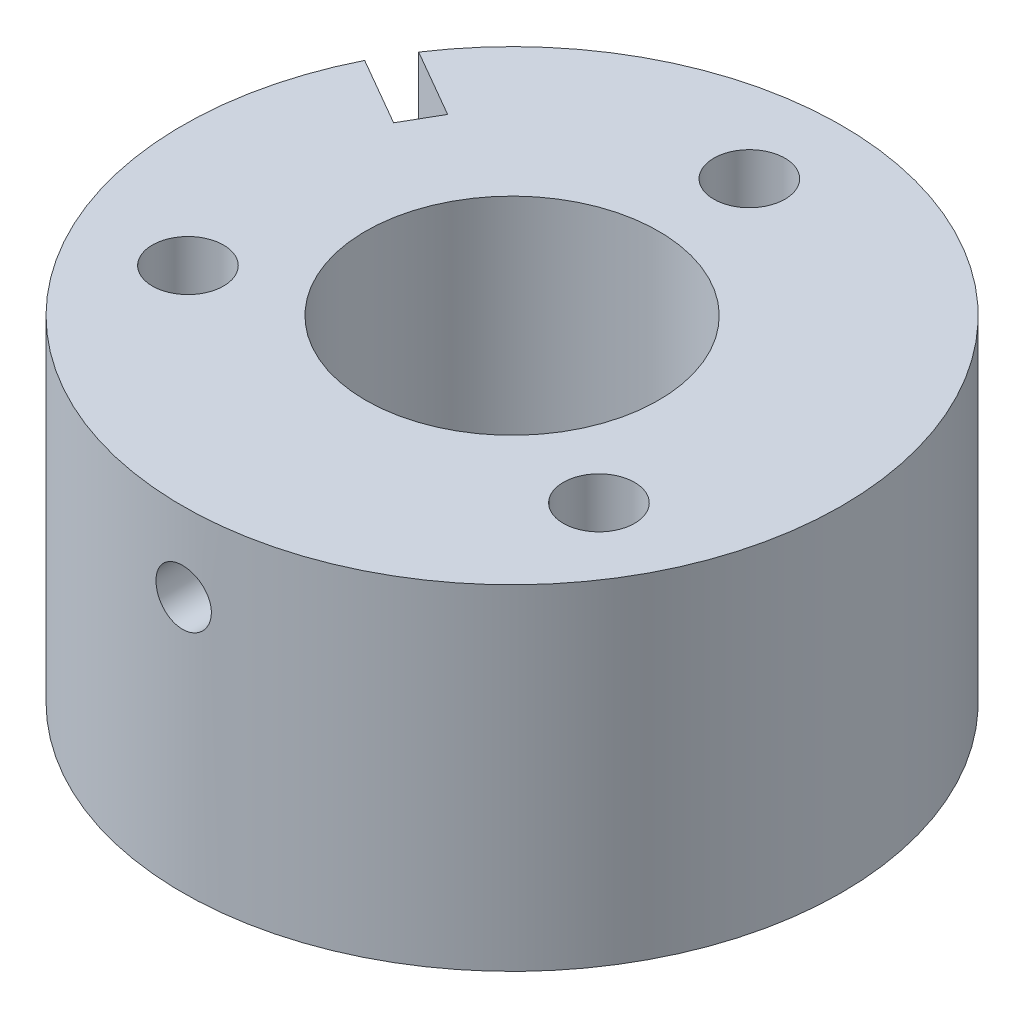
ISO-10303-21;
HEADER;
FILE_DESCRIPTION(('STEP AP214'),'2;1');
FILE_NAME('part.step','',(''),(''),'','','');
FILE_SCHEMA(('AUTOMOTIVE_DESIGN { 1 0 10303 214 1 1 1 1 }'));
ENDSEC;
DATA;
#1=APPLICATION_CONTEXT('core data for automotive mechanical design processes');
#2=APPLICATION_PROTOCOL_DEFINITION('international standard','automotive_design',2000,#1);
#3=PRODUCT_CONTEXT('',#1,'mechanical');
#4=PRODUCT('Part','Part','',(#3));
#5=PRODUCT_RELATED_PRODUCT_CATEGORY('part','',(#4));
#6=PRODUCT_DEFINITION_FORMATION('','',#4);
#7=PRODUCT_DEFINITION_CONTEXT('part definition',#1,'design');
#8=PRODUCT_DEFINITION('design','',#6,#7);
#9=PRODUCT_DEFINITION_SHAPE('','',#8);
#10=(LENGTH_UNIT() NAMED_UNIT(*) SI_UNIT(.MILLI.,.METRE.));
#11=(NAMED_UNIT(*) PLANE_ANGLE_UNIT() SI_UNIT($,.RADIAN.));
#12=(NAMED_UNIT(*) SI_UNIT($,.STERADIAN.) SOLID_ANGLE_UNIT());
#13=UNCERTAINTY_MEASURE_WITH_UNIT(LENGTH_MEASURE(1.E-05),#10,'distance_accuracy_value','');
#14=(GEOMETRIC_REPRESENTATION_CONTEXT(3) GLOBAL_UNCERTAINTY_ASSIGNED_CONTEXT((#13)) GLOBAL_UNIT_ASSIGNED_CONTEXT((#10,
#11,#12)) REPRESENTATION_CONTEXT('',''));
#15=CARTESIAN_POINT('',(0.,0.,0.));
#16=DIRECTION('',(0.,0.,1.));
#17=DIRECTION('',(1.,0.,0.));
#18=AXIS2_PLACEMENT_3D('',#15,#16,#17);
#19=CARTESIAN_POINT('',(0.,12.7,0.));
#20=DIRECTION('',(0.,1.,0.));
#21=DIRECTION('',(0.,0.,1.));
#22=AXIS2_PLACEMENT_3D('',#19,#20,#21);
#23=PLANE('',#22);
#24=CARTESIAN_POINT('',(15.5884572681199,12.7,8.99999999999999));
#25=DIRECTION('',(0.,1.,0.));
#26=DIRECTION('',(0.,0.,1.));
#27=AXIS2_PLACEMENT_3D('',#24,#25,#26);
#28=CIRCLE('',#27,2.6999999999993);
#29=CARTESIAN_POINT('',(15.5884572681199,12.7,11.6999999999993));
#30=VERTEX_POINT('',#29);
#31=EDGE_CURVE('E128',#30,#30,#28,.T.);
#32=ORIENTED_EDGE('',*,*,#31,.F.);
#33=EDGE_LOOP('',(#32));
#34=FACE_BOUND('',#33,.T.);
#35=CARTESIAN_POINT('',(0.,12.7,0.));
#36=DIRECTION('',(0.,1.,0.));
#37=DIRECTION('',(0.,0.,1.));
#38=AXIS2_PLACEMENT_3D('',#35,#36,#37);
#39=CIRCLE('',#38,11.1125);
#40=CARTESIAN_POINT('',(0.,12.7,11.1125));
#41=VERTEX_POINT('',#40);
#42=EDGE_CURVE('E107',#41,#41,#39,.T.);
#43=ORIENTED_EDGE('',*,*,#42,.F.);
#44=EDGE_LOOP('',(#43));
#45=FACE_BOUND('',#44,.T.);
#46=CARTESIAN_POINT('',(0.,12.7,0.));
#47=DIRECTION('',(0.,1.,0.));
#48=DIRECTION('',(0.,0.,1.));
#49=AXIS2_PLACEMENT_3D('',#46,#47,#48);
#50=CIRCLE('',#49,25.0000000000001);
#51=CARTESIAN_POINT('',(-22.3616288141362,12.7,-11.1784416077912));
#52=VERTEX_POINT('',#51);
#53=CARTESIAN_POINT('',(-20.8616288141362,12.7,-13.7765178191445));
#54=VERTEX_POINT('',#53);
#55=EDGE_CURVE('E92',#52,#54,#50,.T.);
#56=ORIENTED_EDGE('',*,*,#55,.T.);
#57=DIRECTION('',(0.866025403784439,0.,0.5));
#58=VECTOR('',#57,1.);
#59=CARTESIAN_POINT('',(-15.6654763914296,12.7,-10.7765178191445));
#60=LINE('',#59,#58);
#61=CARTESIAN_POINT('',(-15.6654763914296,12.7,-10.7765178191445));
#62=VERTEX_POINT('',#61);
#63=EDGE_CURVE('E87',#54,#62,#60,.T.);
#64=ORIENTED_EDGE('',*,*,#63,.T.);
#65=DIRECTION('',(-0.5,0.,0.866025403784439));
#66=VECTOR('',#65,1.);
#67=CARTESIAN_POINT('',(-15.6654763914296,12.7,-10.7765178191445));
#68=LINE('',#67,#66);
#69=CARTESIAN_POINT('',(-17.1654763914296,12.7,-8.17844160779118));
#70=VERTEX_POINT('',#69);
#71=EDGE_CURVE('E90',#62,#70,#68,.T.);
#72=ORIENTED_EDGE('',*,*,#71,.T.);
#73=DIRECTION('',(-0.866025403784437,0.,-0.500000000000003));
#74=VECTOR('',#73,1.);
#75=CARTESIAN_POINT('',(-17.1654763914296,12.7,-8.17844160779118));
#76=LINE('',#75,#74);
#77=EDGE_CURVE('E57',#70,#52,#76,.T.);
#78=ORIENTED_EDGE('',*,*,#77,.T.);
#79=EDGE_LOOP('',(#56,#64,#72,#78));
#80=FACE_BOUND('',#79,.T.);
#81=CARTESIAN_POINT('',(0.,12.7,-18.));
#82=DIRECTION('',(0.,1.,0.));
#83=DIRECTION('',(0.,0.,1.));
#84=AXIS2_PLACEMENT_3D('',#81,#82,#83);
#85=CIRCLE('',#84,2.6999999999993);
#86=CARTESIAN_POINT('',(0.,12.7,-15.3000000000007));
#87=VERTEX_POINT('',#86);
#88=EDGE_CURVE('E122',#87,#87,#85,.T.);
#89=ORIENTED_EDGE('',*,*,#88,.F.);
#90=EDGE_LOOP('',(#89));
#91=FACE_BOUND('',#90,.T.);
#92=CARTESIAN_POINT('',(-15.5884572681199,12.7,9.00000000000001));
#93=DIRECTION('',(0.,1.,0.));
#94=DIRECTION('',(0.,0.,1.));
#95=AXIS2_PLACEMENT_3D('',#92,#93,#94);
#96=CIRCLE('',#95,2.6999999999993);
#97=CARTESIAN_POINT('',(-15.5884572681199,12.7,11.6999999999993));
#98=VERTEX_POINT('',#97);
#99=EDGE_CURVE('E134',#98,#98,#96,.T.);
#100=ORIENTED_EDGE('',*,*,#99,.F.);
#101=EDGE_LOOP('',(#100));
#102=FACE_BOUND('',#101,.T.);
#103=ADVANCED_FACE('F39',(#34,#45,#80,#91,#102),#23,.T.);
#104=CARTESIAN_POINT('',(0.,-12.7,0.));
#105=DIRECTION('',(0.,1.,0.));
#106=DIRECTION('',(0.,0.,1.));
#107=AXIS2_PLACEMENT_3D('',#104,#105,#106);
#108=PLANE('',#107);
#109=CARTESIAN_POINT('',(0.,-12.7,0.));
#110=DIRECTION('',(0.,1.,0.));
#111=DIRECTION('',(0.,0.,1.));
#112=AXIS2_PLACEMENT_3D('',#109,#110,#111);
#113=CIRCLE('',#112,25.0000000000001);
#114=CARTESIAN_POINT('',(-22.3616288141362,-12.7,-11.1784416077912));
#115=VERTEX_POINT('',#114);
#116=CARTESIAN_POINT('',(-20.8616288141362,-12.7,-13.7765178191445));
#117=VERTEX_POINT('',#116);
#118=EDGE_CURVE('E104',#115,#117,#113,.T.);
#119=ORIENTED_EDGE('',*,*,#118,.F.);
#120=DIRECTION('',(-0.866025403784437,0.,-0.500000000000003));
#121=VECTOR('',#120,1.);
#122=CARTESIAN_POINT('',(-17.1654763914296,-12.7,-8.17844160779118));
#123=LINE('',#122,#121);
#124=CARTESIAN_POINT('',(-17.1654763914296,-12.7,-8.17844160779118));
#125=VERTEX_POINT('',#124);
#126=EDGE_CURVE('E80',#125,#115,#123,.T.);
#127=ORIENTED_EDGE('',*,*,#126,.F.);
#128=DIRECTION('',(-0.5,0.,0.866025403784439));
#129=VECTOR('',#128,1.);
#130=CARTESIAN_POINT('',(-15.6654763914296,-12.7,-10.7765178191445));
#131=LINE('',#130,#129);
#132=CARTESIAN_POINT('',(-15.6654763914296,-12.7,-10.7765178191445));
#133=VERTEX_POINT('',#132);
#134=EDGE_CURVE('E74',#133,#125,#131,.T.);
#135=ORIENTED_EDGE('',*,*,#134,.F.);
#136=DIRECTION('',(0.866025403784439,0.,0.5));
#137=VECTOR('',#136,1.);
#138=CARTESIAN_POINT('',(-15.6654763914296,-12.7,-10.7765178191445));
#139=LINE('',#138,#137);
#140=EDGE_CURVE('E96',#117,#133,#139,.T.);
#141=ORIENTED_EDGE('',*,*,#140,.F.);
#142=EDGE_LOOP('',(#119,#127,#135,#141));
#143=FACE_BOUND('',#142,.T.);
#144=CARTESIAN_POINT('',(0.,-12.7,0.));
#145=DIRECTION('',(0.,1.,0.));
#146=DIRECTION('',(0.,0.,1.));
#147=AXIS2_PLACEMENT_3D('',#144,#145,#146);
#148=CIRCLE('',#147,11.1125);
#149=CARTESIAN_POINT('',(0.,-12.7,11.1125));
#150=VERTEX_POINT('',#149);
#151=EDGE_CURVE('E119',#150,#150,#148,.T.);
#152=ORIENTED_EDGE('',*,*,#151,.T.);
#153=EDGE_LOOP('',(#152));
#154=FACE_BOUND('',#153,.T.);
#155=CARTESIAN_POINT('',(0.,-12.7,-18.));
#156=DIRECTION('',(0.,1.,0.));
#157=DIRECTION('',(0.,0.,1.));
#158=AXIS2_PLACEMENT_3D('',#155,#156,#157);
#159=CIRCLE('',#158,2.6999999999993);
#160=CARTESIAN_POINT('',(0.,-12.7,-15.3000000000007));
#161=VERTEX_POINT('',#160);
#162=EDGE_CURVE('E125',#161,#161,#159,.T.);
#163=ORIENTED_EDGE('',*,*,#162,.T.);
#164=EDGE_LOOP('',(#163));
#165=FACE_BOUND('',#164,.T.);
#166=CARTESIAN_POINT('',(15.5884572681199,-12.7,8.99999999999999));
#167=DIRECTION('',(0.,1.,0.));
#168=DIRECTION('',(0.,0.,1.));
#169=AXIS2_PLACEMENT_3D('',#166,#167,#168);
#170=CIRCLE('',#169,2.6999999999993);
#171=CARTESIAN_POINT('',(15.5884572681199,-12.7,11.6999999999993));
#172=VERTEX_POINT('',#171);
#173=EDGE_CURVE('E131',#172,#172,#170,.T.);
#174=ORIENTED_EDGE('',*,*,#173,.T.);
#175=EDGE_LOOP('',(#174));
#176=FACE_BOUND('',#175,.T.);
#177=CARTESIAN_POINT('',(-15.5884572681199,-12.7,9.00000000000001));
#178=DIRECTION('',(0.,1.,0.));
#179=DIRECTION('',(0.,0.,1.));
#180=AXIS2_PLACEMENT_3D('',#177,#178,#179);
#181=CIRCLE('',#180,2.6999999999993);
#182=CARTESIAN_POINT('',(-15.5884572681199,-12.7,11.6999999999993));
#183=VERTEX_POINT('',#182);
#184=EDGE_CURVE('E137',#183,#183,#181,.T.);
#185=ORIENTED_EDGE('',*,*,#184,.T.);
#186=EDGE_LOOP('',(#185));
#187=FACE_BOUND('',#186,.T.);
#188=ADVANCED_FACE('F115',(#143,#154,#165,#176,#187),#108,.F.);
#189=CARTESIAN_POINT('',(0.,12.7,0.));
#190=DIRECTION('',(0.,-1.,0.));
#191=DIRECTION('',(0.,0.,-1.));
#192=AXIS2_PLACEMENT_3D('',#189,#190,#191);
#193=CYLINDRICAL_SURFACE('',#192,25.0000000000001);
#194=CARTESIAN_POINT('',(2.09999999999999,6.7,24.9116438638642));
#195=CARTESIAN_POINT('',(2.09999485837673,6.5822655479677,24.9116450340083));
#196=CARTESIAN_POINT('',(2.0900656885766,6.46445102839802,24.9124874834673));
#197=CARTESIAN_POINT('',(2.0506026486121,6.2320820056589,24.9157662067991));
#198=CARTESIAN_POINT('',(2.02104658688871,6.11753134591671,24.9182042847579));
#199=CARTESIAN_POINT('',(1.94319080564175,5.89508914344277,24.9243961881864));
#200=CARTESIAN_POINT('',(1.8949017392842,5.7871938562515,24.9281492657193));
#201=CARTESIAN_POINT('',(1.78096970235171,5.58106572133331,24.9365473557691));
#202=CARTESIAN_POINT('',(1.71533043218995,5.48283081938307,24.9411921780388));
#203=CARTESIAN_POINT('',(1.5683764393424,5.29853036396334,24.9508639946303));
#204=CARTESIAN_POINT('',(1.48702583714909,5.21249346186846,24.9558918474412));
#205=CARTESIAN_POINT('',(1.31103436432751,5.05527744226912,24.9657553521438));
#206=CARTESIAN_POINT('',(1.21639291236684,4.98409897500091,24.9705909956166));
#207=CARTESIAN_POINT('',(1.01633518620386,4.8585248477625,24.9795333807492));
#208=CARTESIAN_POINT('',(0.910903282822711,4.80415400375027,24.9836390408491));
#209=CARTESIAN_POINT('',(0.692366478248451,4.71389724938874,24.9906496091806));
#210=CARTESIAN_POINT('',(0.579261713319254,4.67801101086477,24.9935545387296));
#211=CARTESIAN_POINT('',(0.348875196706301,4.62582469122496,24.9978303389121));
#212=CARTESIAN_POINT('',(0.231604021202069,4.60947822187939,24.9992048423071));
#213=CARTESIAN_POINT('',(-0.00402498468595406,4.59669205075256,25.0002772328337));
#214=CARTESIAN_POINT('',(-0.122382794528716,4.60025197344415,24.9999751515934));
#215=CARTESIAN_POINT('',(-0.356510772580105,4.62713960525297,24.9977314059567));
#216=CARTESIAN_POINT('',(-0.472286714690108,4.65041743058994,24.9957938790727));
#217=CARTESIAN_POINT('',(-0.698282390737076,4.71600252564907,24.9905019225894));
#218=CARTESIAN_POINT('',(-0.808502071078081,4.75830997889286,24.9871474793254));
#219=CARTESIAN_POINT('',(-1.02041516909043,4.8608089398128,24.9793919423598));
#220=CARTESIAN_POINT('',(-1.12209773588735,4.92102277851909,24.9749895431297));
#221=CARTESIAN_POINT('',(-1.31393178034515,5.05760904543361,24.965632801841));
#222=CARTESIAN_POINT('',(-1.40408302023144,5.13398180675075,24.9606784484051));
#223=CARTESIAN_POINT('',(-1.57058703233806,5.30099910253072,24.9507564963594));
#224=CARTESIAN_POINT('',(-1.64689633036721,5.39168698463369,24.9457889040978));
#225=CARTESIAN_POINT('',(-1.7832144194432,5.58460918774314,24.9364157410182));
#226=CARTESIAN_POINT('',(-1.84322319673741,5.68684351849117,24.9320101706744));
#227=CARTESIAN_POINT('',(-1.9452352132766,5.8999871910908,24.9242590728123));
#228=CARTESIAN_POINT('',(-1.98723618059359,6.01089762546383,24.9209136790635));
#229=CARTESIAN_POINT('',(-2.05200805519726,6.23823052951627,24.9156643136639));
#230=CARTESIAN_POINT('',(-2.07477937335143,6.35465288136996,24.913760311216));
#231=CARTESIAN_POINT('',(-2.1003904872527,6.5893243515587,24.9116143147338));
#232=CARTESIAN_POINT('',(-2.10329091543526,6.70756680842718,24.9113672648563));
#233=CARTESIAN_POINT('',(-2.0892367577445,6.94285625286254,24.9125498004859));
#234=CARTESIAN_POINT('',(-2.07228236008529,7.05990325175117,24.9139793700996));
#235=CARTESIAN_POINT('',(-2.01905037765816,7.28930508015701,24.9183494582227));
#236=CARTESIAN_POINT('',(-1.98280110224445,7.40166652452233,24.9212877629006));
#237=CARTESIAN_POINT('',(-1.89203713238139,7.61871264576482,24.9283424129882));
#238=CARTESIAN_POINT('',(-1.83752214022684,7.72339719748567,24.9324587775985));
#239=CARTESIAN_POINT('',(-1.71162084891762,7.92239534039936,24.9414179916391));
#240=CARTESIAN_POINT('',(-1.6401941539115,8.01668329509456,24.9462625702289));
#241=CARTESIAN_POINT('',(-1.48255532413534,8.1919526188989,24.9561265079214));
#242=CARTESIAN_POINT('',(-1.39634293089238,8.27293375533937,24.9611458700783));
#243=CARTESIAN_POINT('',(-1.2113179096318,8.41949772109362,24.9708088774811));
#244=CARTESIAN_POINT('',(-1.11247401302687,8.48504114992997,24.9754515419526));
#245=CARTESIAN_POINT('',(-0.905147552473084,8.59859879154609,24.9838239053897));
#246=CARTESIAN_POINT('',(-0.796665086184913,8.6466131819098,24.9875536136041));
#247=CARTESIAN_POINT('',(-0.573281955114179,8.72368216325211,24.9936753143798));
#248=CARTESIAN_POINT('',(-0.458389738137441,8.75276109817345,24.9960690239694));
#249=CARTESIAN_POINT('',(-0.225332660676086,8.79121328415376,24.9992559942986));
#250=CARTESIAN_POINT('',(-0.107167863276114,8.80058691479902,25.0000492858673));
#251=CARTESIAN_POINT('',(0.128691779064639,8.79935794803171,24.9999460825968));
#252=CARTESIAN_POINT('',(0.24638695105143,8.78881674589167,24.9990547811718));
#253=CARTESIAN_POINT('',(0.478329052487317,8.74818539505718,24.9956928100986));
#254=CARTESIAN_POINT('',(0.592575977314614,8.7180952201618,24.9932221383337));
#255=CARTESIAN_POINT('',(0.814382353868544,8.6392357306572,24.9869786240988));
#256=CARTESIAN_POINT('',(0.921942209668017,8.59046754596302,24.9832058603995));
#257=CARTESIAN_POINT('',(1.12735778964129,8.47564340609865,24.974780183067));
#258=CARTESIAN_POINT('',(1.22521366367532,8.40958771795963,24.9701272830291));
#259=CARTESIAN_POINT('',(1.40875773536067,8.26183319533304,24.9604464652695));
#260=CARTESIAN_POINT('',(1.4944092918562,8.1800889141873,24.9554174846036));
#261=CARTESIAN_POINT('',(1.65081115644468,8.00336008506129,24.9455603449089));
#262=CARTESIAN_POINT('',(1.72155785197054,7.90837233644375,24.9407322347931));
#263=CARTESIAN_POINT('',(1.84623917423496,7.70766567114242,24.9318135639044));
#264=CARTESIAN_POINT('',(1.90014164331661,7.60192673283718,24.927724420105));
#265=CARTESIAN_POINT('',(1.98935804681594,7.38293673556059,24.9207639444562));
#266=CARTESIAN_POINT('',(2.02469333764755,7.26969447674104,24.9178912142009));
#267=CARTESIAN_POINT('',(2.06677973771762,7.07982091341846,24.9144271143426));
#268=CARTESIAN_POINT('',(2.07922075910347,7.00441052259926,24.9133881984112));
#269=CARTESIAN_POINT('',(2.09583254620122,6.85267797852993,24.9119961946669));
#270=CARTESIAN_POINT('',(2.10000333456259,6.77635582777737,24.9116431049758));
#271=CARTESIAN_POINT('',(2.09999999999999,6.7,24.9116438638642));
#272=B_SPLINE_CURVE_WITH_KNOTS('',3,(#194,#195,#196,#197,#198,#199,#200,#201,#202,#203,#204,
#205,#206,#207,#208,#209,#210,#211,#212,#213,#214,#215,#216,#217,#218,#219,#220,#221,#222,#223,
#224,#225,#226,#227,#228,#229,#230,#231,#232,#233,#234,#235,#236,#237,#238,#239,#240,#241,#242,
#243,#244,#245,#246,#247,#248,#249,#250,#251,#252,#253,#254,#255,#256,#257,#258,#259,#260,#261,
#262,#263,#264,#265,#266,#267,#268,#269,#270,#271),.UNSPECIFIED.,.T.,.F.,(4,2,2,2,2,2,2,2,2,2,2,
2,2,2,2,2,2,2,2,2,2,2,2,2,2,2,2,2,2,2,2,2,2,2,2,2,2,2,4),(0.,0.352924564741408,
0.706248852067277,1.05937250326541,1.41242090171379,1.76628528912413,2.12016515913678,
2.47456505390479,2.82895865645983,3.182509232121,3.53605313819641,3.88870528539034,
4.24136083363274,4.59445803577916,4.9475625175748,5.30175750564979,5.65595279255557,
6.01019275283161,6.36442514409968,6.717576175831,7.07072385988884,7.42335482977172,
7.77599154731726,8.1294792368188,8.48297310636746,8.83735962501163,9.19174255332186,
9.54566897293586,9.89958857474849,10.2524188609051,10.6052496199508,10.9580590380811,
11.3108630068674,11.6647048383769,12.018632333919,12.3732314489986,12.7274217978749,
12.9563090999367,13.1851957751506),.UNSPECIFIED.);
#273=CARTESIAN_POINT('',(2.09999999999999,6.7,24.9116438638642));
#274=VERTEX_POINT('',#273);
#275=EDGE_CURVE('E140',#274,#274,#272,.T.);
#276=ORIENTED_EDGE('',*,*,#275,.T.);
#277=EDGE_LOOP('',(#276));
#278=FACE_BOUND('',#277,.T.);
#279=ORIENTED_EDGE('',*,*,#118,.T.);
#280=DIRECTION('',(0.,-1.,0.));
#281=VECTOR('',#280,1.);
#282=CARTESIAN_POINT('',(-20.8616288141362,12.7,-13.7765178191445));
#283=LINE('',#282,#281);
#284=EDGE_CURVE('E12',#54,#117,#283,.T.);
#285=ORIENTED_EDGE('',*,*,#284,.F.);
#286=ORIENTED_EDGE('',*,*,#55,.F.);
#287=DIRECTION('',(0.,-1.,0.));
#288=VECTOR('',#287,1.);
#289=CARTESIAN_POINT('',(-22.3616288141362,12.7,-11.1784416077912));
#290=LINE('',#289,#288);
#291=EDGE_CURVE('E100',#52,#115,#290,.T.);
#292=ORIENTED_EDGE('',*,*,#291,.T.);
#293=EDGE_LOOP('',(#279,#285,#286,#292));
#294=FACE_BOUND('',#293,.T.);
#295=ADVANCED_FACE('F41',(#278,#294),#193,.T.);
#296=CARTESIAN_POINT('',(-15.6654763914296,12.7,-10.7765178191445));
#297=DIRECTION('',(0.5,0.,-0.866025403784439));
#298=DIRECTION('',(-0.866025403784439,0.,-0.5));
#299=AXIS2_PLACEMENT_3D('',#296,#297,#298);
#300=PLANE('',#299);
#301=ORIENTED_EDGE('',*,*,#140,.T.);
#302=DIRECTION('',(0.,-1.,0.));
#303=VECTOR('',#302,1.);
#304=CARTESIAN_POINT('',(-15.6654763914296,12.7,-10.7765178191445));
#305=LINE('',#304,#303);
#306=EDGE_CURVE('E49',#62,#133,#305,.T.);
#307=ORIENTED_EDGE('',*,*,#306,.F.);
#308=ORIENTED_EDGE('',*,*,#63,.F.);
#309=ORIENTED_EDGE('',*,*,#284,.T.);
#310=EDGE_LOOP('',(#301,#307,#308,#309));
#311=FACE_BOUND('',#310,.T.);
#312=ADVANCED_FACE('F95',(#311),#300,.F.);
#313=CARTESIAN_POINT('',(-15.6654763914296,12.7,-10.7765178191445));
#314=DIRECTION('',(0.866025403784439,0.,0.5));
#315=DIRECTION('',(0.5,0.,-0.866025403784439));
#316=AXIS2_PLACEMENT_3D('',#313,#314,#315);
#317=PLANE('',#316);
#318=ORIENTED_EDGE('',*,*,#134,.T.);
#319=DIRECTION('',(0.,-1.,0.));
#320=VECTOR('',#319,1.);
#321=CARTESIAN_POINT('',(-17.1654763914296,12.7,-8.17844160779118));
#322=LINE('',#321,#320);
#323=EDGE_CURVE('E97',#70,#125,#322,.T.);
#324=ORIENTED_EDGE('',*,*,#323,.F.);
#325=ORIENTED_EDGE('',*,*,#71,.F.);
#326=ORIENTED_EDGE('',*,*,#306,.T.);
#327=EDGE_LOOP('',(#318,#324,#325,#326));
#328=FACE_BOUND('',#327,.T.);
#329=ADVANCED_FACE('F98',(#328),#317,.F.);
#330=CARTESIAN_POINT('',(-17.1654763914296,12.7,-8.17844160779118));
#331=DIRECTION('',(-0.500000000000003,0.,0.866025403784437));
#332=DIRECTION('',(0.866025403784437,0.,0.500000000000003));
#333=AXIS2_PLACEMENT_3D('',#330,#331,#332);
#334=PLANE('',#333);
#335=ORIENTED_EDGE('',*,*,#126,.T.);
#336=ORIENTED_EDGE('',*,*,#291,.F.);
#337=ORIENTED_EDGE('',*,*,#77,.F.);
#338=ORIENTED_EDGE('',*,*,#323,.T.);
#339=EDGE_LOOP('',(#335,#336,#337,#338));
#340=FACE_BOUND('',#339,.T.);
#341=ADVANCED_FACE('F112',(#340),#334,.F.);
#342=CARTESIAN_POINT('',(0.,12.7,0.));
#343=DIRECTION('',(0.,-1.,0.));
#344=DIRECTION('',(0.,0.,-1.));
#345=AXIS2_PLACEMENT_3D('',#342,#343,#344);
#346=CYLINDRICAL_SURFACE('',#345,11.1125);
#347=CARTESIAN_POINT('',(2.09999999999999,6.7,10.9122709025207));
#348=CARTESIAN_POINT('',(2.0999955367739,6.5831776725626,10.9122731720293));
#349=CARTESIAN_POINT('',(2.09021873958249,6.46629763702708,10.9141672554256));
#350=CARTESIAN_POINT('',(2.05139695079562,6.23583453605666,10.9215293088746));
#351=CARTESIAN_POINT('',(2.02233572061861,6.12225433347136,10.9270002908206));
#352=CARTESIAN_POINT('',(1.94587044421264,5.90175880230469,10.9408748883712));
#353=CARTESIAN_POINT('',(1.89848361746185,5.79483732609091,10.9492757502158));
#354=CARTESIAN_POINT('',(1.78675807334894,5.59046823558502,10.968060280524));
#355=CARTESIAN_POINT('',(1.72242063526869,5.49301990710318,10.9784437993378));
#356=CARTESIAN_POINT('',(1.57775333922263,5.30912454413574,11.0001702853147));
#357=CARTESIAN_POINT('',(1.49725057035395,5.22281464157227,11.0115227888965));
#358=CARTESIAN_POINT('',(1.32291147633107,5.06484122087068,11.0338239091113));
#359=CARTESIAN_POINT('',(1.22907426982887,4.99317867162259,11.0447724989871));
#360=CARTESIAN_POINT('',(1.02982842734246,4.86600794726068,11.0651344198203));
#361=CARTESIAN_POINT('',(0.924335801235032,4.81062918343257,11.0745352037444));
#362=CARTESIAN_POINT('',(0.705336618834384,4.71843193771824,11.0906355108911));
#363=CARTESIAN_POINT('',(0.591830732759589,4.68161190569608,11.0973352597109));
#364=CARTESIAN_POINT('',(0.361448324692017,4.62800168090523,11.1072112576845));
#365=CARTESIAN_POINT('',(0.244627378471799,4.61098027011072,11.1104281499869));
#366=CARTESIAN_POINT('',(0.00974654550990312,4.59672991318893,11.1131160972264));
#367=CARTESIAN_POINT('',(-0.108313233254427,4.59949925616381,11.1125874759607));
#368=CARTESIAN_POINT('',(-0.340734413461381,4.6245746922461,11.1078756879891));
#369=CARTESIAN_POINT('',(-0.455123757091938,4.64663180973267,11.1037390963884));
#370=CARTESIAN_POINT('',(-0.678547859691516,4.70926276812196,11.0923284307098));
#371=CARTESIAN_POINT('',(-0.78758242108531,4.74983729169314,11.0850542409608));
#372=CARTESIAN_POINT('',(-0.997922676431508,4.84858777168033,11.0681079947971));
#373=CARTESIAN_POINT('',(-1.09918062190655,4.90686302714488,11.0584224678263));
#374=CARTESIAN_POINT('',(-1.29057337114191,5.03928754745696,11.0377242745206));
#375=CARTESIAN_POINT('',(-1.38070702502431,5.11343845115019,11.0267114712221));
#376=CARTESIAN_POINT('',(-1.54876806547956,5.27688068048048,11.0043757202372));
#377=CARTESIAN_POINT('',(-1.62648346935353,5.36638983523783,10.9930506135566));
#378=CARTESIAN_POINT('',(-1.76583171985941,5.55728271124655,10.9715304811471));
#379=CARTESIAN_POINT('',(-1.82746432373698,5.65866661170229,10.9613354724773));
#380=CARTESIAN_POINT('',(-1.9329593475883,5.87071481483054,10.9432265836547));
#381=CARTESIAN_POINT('',(-1.97679055670021,5.98139501014514,10.9353167169467));
#382=CARTESIAN_POINT('',(-2.04517503345534,6.20873194177658,10.9227348389634));
#383=CARTESIAN_POINT('',(-2.06973052277478,6.32538798767876,10.9180624545504));
#384=CARTESIAN_POINT('',(-2.09855617218398,6.55945251589972,10.9125584939604));
#385=CARTESIAN_POINT('',(-2.1031310674007,6.67682215186195,10.9116692248788));
#386=CARTESIAN_POINT('',(-2.09268290366999,6.91064816656487,10.9136777405538));
#387=CARTESIAN_POINT('',(-2.07766083011871,7.02710459092845,10.9165753348952));
#388=CARTESIAN_POINT('',(-2.02870688554523,7.25479399046216,10.9257773175195));
#389=CARTESIAN_POINT('',(-1.99493512119612,7.36606266027794,10.9320528474171));
#390=CARTESIAN_POINT('',(-1.90961048309927,7.58136217614086,10.9472786926308));
#391=CARTESIAN_POINT('',(-1.85805628083899,7.68539248071717,10.9562292077865));
#392=CARTESIAN_POINT('',(-1.73793016040536,7.88460368414241,10.9759277015061));
#393=CARTESIAN_POINT('',(-1.66916594697882,7.97966662919324,10.9866955097849));
#394=CARTESIAN_POINT('',(-1.51683072731402,8.1570147903042,11.0087597070233));
#395=CARTESIAN_POINT('',(-1.43325836774199,8.23929883719505,11.0200561442253));
#396=CARTESIAN_POINT('',(-1.25231732609943,8.3898938880808,11.0420903802313));
#397=CARTESIAN_POINT('',(-1.15477659883446,8.45799981842735,11.0528185017238));
#398=CARTESIAN_POINT('',(-0.949460665834747,8.57685719858552,11.0723438827475));
#399=CARTESIAN_POINT('',(-0.841685858665859,8.62760932388653,11.081141217429));
#400=CARTESIAN_POINT('',(-0.619524545359651,8.71001236551094,11.0957722202823));
#401=CARTESIAN_POINT('',(-0.505176279367392,8.74176350122913,11.1016214119525));
#402=CARTESIAN_POINT('',(-0.272648970807709,8.78558284732233,11.1097633463993));
#403=CARTESIAN_POINT('',(-0.154470339364746,8.79765316300973,11.1120564695772));
#404=CARTESIAN_POINT('',(0.0803972891838728,8.8016939899368,11.1128201655339));
#405=CARTESIAN_POINT('',(0.197080881381392,8.79397406981995,11.111349612187));
#406=CARTESIAN_POINT('',(0.427456532230915,8.75933220578829,11.1048736946553));
#407=CARTESIAN_POINT('',(0.541148620533428,8.73241045226823,11.0998683655194));
#408=CARTESIAN_POINT('',(0.762146969547954,8.66026041349813,11.0868854665451));
#409=CARTESIAN_POINT('',(0.869464487224599,8.6150655702978,11.0789133284492));
#410=CARTESIAN_POINT('',(1.07503902776272,8.50768960303365,11.0608592784744));
#411=CARTESIAN_POINT('',(1.17329543016954,8.44550731691792,11.0507772222746));
#412=CARTESIAN_POINT('',(1.3594998456098,8.30485847226588,11.0294305503879));
#413=CARTESIAN_POINT('',(1.44727740662851,8.22616851137029,11.018150885569));
#414=CARTESIAN_POINT('',(1.60848914308808,8.05520109249419,10.9957746117609));
#415=CARTESIAN_POINT('',(1.68191993794312,7.96292044104726,10.9846780464788));
#416=CARTESIAN_POINT('',(1.81300472286115,7.76635045109421,10.9638099937582));
#417=CARTESIAN_POINT('',(1.87050352093688,7.66195614439804,10.9540519784524));
#418=CARTESIAN_POINT('',(1.96705480165005,7.44483797321244,10.9371282336899));
#419=CARTESIAN_POINT('',(2.00612461865371,7.33212205196791,10.9299600697014));
#420=CARTESIAN_POINT('',(2.05681029665247,7.13256842996282,10.9205149739793));
#421=CARTESIAN_POINT('',(2.07297853784586,7.04689569676299,10.9174418979957));
#422=CARTESIAN_POINT('',(2.09457490292738,6.87415930832357,10.9133190445856));
#423=CARTESIAN_POINT('',(2.10000332751258,6.78709569209521,10.9122692105118));
#424=CARTESIAN_POINT('',(2.09999999999999,6.7,10.9122709025207));
#425=B_SPLINE_CURVE_WITH_KNOTS('',3,(#347,#348,#349,#350,#351,#352,#353,#354,#355,#356,#357,
#358,#359,#360,#361,#362,#363,#364,#365,#366,#367,#368,#369,#370,#371,#372,#373,#374,#375,#376,
#377,#378,#379,#380,#381,#382,#383,#384,#385,#386,#387,#388,#389,#390,#391,#392,#393,#394,#395,
#396,#397,#398,#399,#400,#401,#402,#403,#404,#405,#406,#407,#408,#409,#410,#411,#412,#413,#414,
#415,#416,#417,#418,#419,#420,#421,#422,#423,#424),.UNSPECIFIED.,.T.,.F.,(4,2,2,2,2,2,2,2,2,2,2,
2,2,2,2,2,2,2,2,2,2,2,2,2,2,2,2,2,2,2,2,2,2,2,2,2,2,2,4),(0.,0.350148234717351,
0.700591688803032,1.05070664889548,1.40079519298002,1.75484965524944,2.10892752986414,
2.46574767564355,2.82253801273596,3.17511835896527,3.52766822522104,3.87573329605697,
4.22381119980482,4.57387902020982,4.92398299561086,5.27953996652265,5.63510230391336,
5.99128537866867,6.34742739453148,6.69811829009671,7.04879155251977,7.39651541868226,
7.74426526866161,8.09608918570935,8.44794527295558,8.80458271782255,9.16120627914994,
9.51593188512358,9.87061954261642,10.2197929701759,10.5689629355729,10.9174967478753,
11.2660544081369,11.6196746818085,11.9733781802096,12.3304147713743,12.6871148596314,
12.9481716061654,13.2092210434398),.UNSPECIFIED.);
#426=CARTESIAN_POINT('',(2.09999999999999,6.7,10.9122709025207));
#427=VERTEX_POINT('',#426);
#428=EDGE_CURVE('E148',#427,#427,#425,.T.);
#429=ORIENTED_EDGE('',*,*,#428,.F.);
#430=EDGE_LOOP('',(#429));
#431=FACE_BOUND('',#430,.T.);
#432=ORIENTED_EDGE('',*,*,#42,.T.);
#433=EDGE_LOOP('',(#432));
#434=FACE_BOUND('',#433,.T.);
#435=ORIENTED_EDGE('',*,*,#151,.F.);
#436=EDGE_LOOP('',(#435));
#437=FACE_BOUND('',#436,.T.);
#438=ADVANCED_FACE('F170',(#431,#434,#437),#346,.F.);
#439=CARTESIAN_POINT('',(0.,12.7,-18.));
#440=DIRECTION('',(0.,-1.,0.));
#441=DIRECTION('',(0.,0.,-1.));
#442=AXIS2_PLACEMENT_3D('',#439,#440,#441);
#443=CYLINDRICAL_SURFACE('',#442,2.6999999999993);
#444=ORIENTED_EDGE('',*,*,#88,.T.);
#445=EDGE_LOOP('',(#444));
#446=FACE_BOUND('',#445,.T.);
#447=ORIENTED_EDGE('',*,*,#162,.F.);
#448=EDGE_LOOP('',(#447));
#449=FACE_BOUND('',#448,.T.);
#450=ADVANCED_FACE('F166',(#446,#449),#443,.F.);
#451=CARTESIAN_POINT('',(15.5884572681199,12.7,8.99999999999999));
#452=DIRECTION('',(0.,-1.,0.));
#453=DIRECTION('',(0.,0.,-1.));
#454=AXIS2_PLACEMENT_3D('',#451,#452,#453);
#455=CYLINDRICAL_SURFACE('',#454,2.6999999999993);
#456=ORIENTED_EDGE('',*,*,#31,.T.);
#457=EDGE_LOOP('',(#456));
#458=FACE_BOUND('',#457,.T.);
#459=ORIENTED_EDGE('',*,*,#173,.F.);
#460=EDGE_LOOP('',(#459));
#461=FACE_BOUND('',#460,.T.);
#462=ADVANCED_FACE('F162',(#458,#461),#455,.F.);
#463=CARTESIAN_POINT('',(-15.5884572681199,12.7,9.00000000000001));
#464=DIRECTION('',(0.,-1.,0.));
#465=DIRECTION('',(0.,0.,-1.));
#466=AXIS2_PLACEMENT_3D('',#463,#464,#465);
#467=CYLINDRICAL_SURFACE('',#466,2.6999999999993);
#468=ORIENTED_EDGE('',*,*,#99,.T.);
#469=EDGE_LOOP('',(#468));
#470=FACE_BOUND('',#469,.T.);
#471=ORIENTED_EDGE('',*,*,#184,.F.);
#472=EDGE_LOOP('',(#471));
#473=FACE_BOUND('',#472,.T.);
#474=ADVANCED_FACE('F155',(#470,#473),#467,.F.);
#475=CARTESIAN_POINT('',(0.,6.7,25.));
#476=DIRECTION('',(0.,0.,1.));
#477=DIRECTION('',(1.,0.,0.));
#478=AXIS2_PLACEMENT_3D('',#475,#476,#477);
#479=CYLINDRICAL_SURFACE('',#478,2.09999999999999);
#480=ORIENTED_EDGE('',*,*,#428,.T.);
#481=EDGE_LOOP('',(#480));
#482=FACE_BOUND('',#481,.T.);
#483=ORIENTED_EDGE('',*,*,#275,.F.);
#484=EDGE_LOOP('',(#483));
#485=FACE_BOUND('',#484,.T.);
#486=ADVANCED_FACE('F152',(#482,#485),#479,.F.);
#487=CLOSED_SHELL('',(#103,#188,#295,#312,#329,#341,#438,#450,#462,#474,#486));
#488=MANIFOLD_SOLID_BREP('B2',#487);
#489=ADVANCED_BREP_SHAPE_REPRESENTATION('',(#18,#488),#14);
#490=SHAPE_DEFINITION_REPRESENTATION(#9,#489);
ENDSEC;
END-ISO-10303-21;
